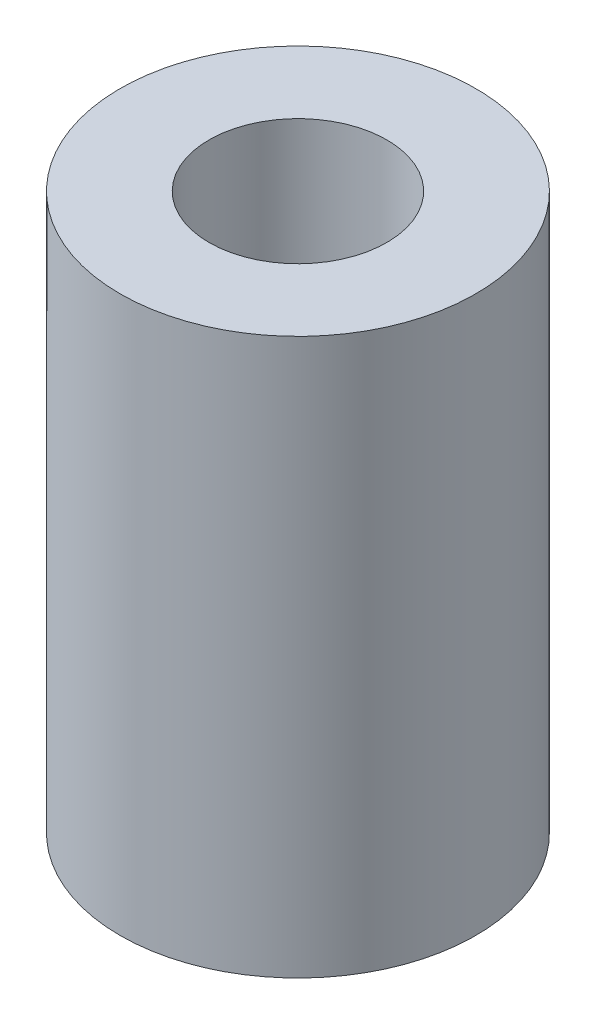
ISO-10303-21;
HEADER;
FILE_DESCRIPTION(('STEP AP214'),'2;1');
FILE_NAME('part.step','',(''),(''),'','','');
FILE_SCHEMA(('AUTOMOTIVE_DESIGN { 1 0 10303 214 1 1 1 1 }'));
ENDSEC;
DATA;
#1=APPLICATION_CONTEXT('core data for automotive mechanical design processes');
#2=APPLICATION_PROTOCOL_DEFINITION('international standard','automotive_design',2000,#1);
#3=PRODUCT_CONTEXT('',#1,'mechanical');
#4=PRODUCT('Part','Part','',(#3));
#5=PRODUCT_RELATED_PRODUCT_CATEGORY('part','',(#4));
#6=PRODUCT_DEFINITION_FORMATION('','',#4);
#7=PRODUCT_DEFINITION_CONTEXT('part definition',#1,'design');
#8=PRODUCT_DEFINITION('design','',#6,#7);
#9=PRODUCT_DEFINITION_SHAPE('','',#8);
#10=(LENGTH_UNIT() NAMED_UNIT(*) SI_UNIT(.MILLI.,.METRE.));
#11=(NAMED_UNIT(*) PLANE_ANGLE_UNIT() SI_UNIT($,.RADIAN.));
#12=(NAMED_UNIT(*) SI_UNIT($,.STERADIAN.) SOLID_ANGLE_UNIT());
#13=UNCERTAINTY_MEASURE_WITH_UNIT(LENGTH_MEASURE(1.E-05),#10,'distance_accuracy_value','');
#14=(GEOMETRIC_REPRESENTATION_CONTEXT(3) GLOBAL_UNCERTAINTY_ASSIGNED_CONTEXT((#13)) GLOBAL_UNIT_ASSIGNED_CONTEXT((#10,
#11,#12)) REPRESENTATION_CONTEXT('',''));
#15=CARTESIAN_POINT('',(0.,0.,0.));
#16=DIRECTION('',(0.,0.,1.));
#17=DIRECTION('',(1.,0.,0.));
#18=AXIS2_PLACEMENT_3D('',#15,#16,#17);
#19=CARTESIAN_POINT('',(0.,12.5,0.));
#20=DIRECTION('',(0.,1.,0.));
#21=DIRECTION('',(0.,0.,1.));
#22=AXIS2_PLACEMENT_3D('',#19,#20,#21);
#23=PLANE('',#22);
#24=CARTESIAN_POINT('',(0.,12.5,0.));
#25=DIRECTION('',(0.,1.,0.));
#26=DIRECTION('',(0.,0.,1.));
#27=AXIS2_PLACEMENT_3D('',#24,#25,#26);
#28=CIRCLE('',#27,4.);
#29=CARTESIAN_POINT('',(0.,12.5,4.));
#30=VERTEX_POINT('',#29);
#31=EDGE_CURVE('E10',#30,#30,#28,.T.);
#32=ORIENTED_EDGE('',*,*,#31,.T.);
#33=EDGE_LOOP('',(#32));
#34=FACE_BOUND('',#33,.T.);
#35=CARTESIAN_POINT('',(0.,12.5,0.));
#36=DIRECTION('',(0.,1.,0.));
#37=DIRECTION('',(0.,0.,1.));
#38=AXIS2_PLACEMENT_3D('',#35,#36,#37);
#39=CIRCLE('',#38,2.);
#40=CARTESIAN_POINT('',(0.,12.5,2.));
#41=VERTEX_POINT('',#40);
#42=EDGE_CURVE('E50',#41,#41,#39,.T.);
#43=ORIENTED_EDGE('',*,*,#42,.F.);
#44=EDGE_LOOP('',(#43));
#45=FACE_BOUND('',#44,.T.);
#46=ADVANCED_FACE('F37',(#34,#45),#23,.T.);
#47=CARTESIAN_POINT('',(0.,0.,0.));
#48=DIRECTION('',(0.,1.,0.));
#49=DIRECTION('',(0.,0.,1.));
#50=AXIS2_PLACEMENT_3D('',#47,#48,#49);
#51=PLANE('',#50);
#52=CARTESIAN_POINT('',(0.,0.,0.));
#53=DIRECTION('',(0.,1.,0.));
#54=DIRECTION('',(0.,0.,1.));
#55=AXIS2_PLACEMENT_3D('',#52,#53,#54);
#56=CIRCLE('',#55,4.);
#57=CARTESIAN_POINT('',(0.,0.,4.));
#58=VERTEX_POINT('',#57);
#59=EDGE_CURVE('E41',#58,#58,#56,.T.);
#60=ORIENTED_EDGE('',*,*,#59,.F.);
#61=EDGE_LOOP('',(#60));
#62=FACE_BOUND('',#61,.T.);
#63=CARTESIAN_POINT('',(0.,0.,0.));
#64=DIRECTION('',(0.,1.,0.));
#65=DIRECTION('',(0.,0.,1.));
#66=AXIS2_PLACEMENT_3D('',#63,#64,#65);
#67=CIRCLE('',#66,2.);
#68=CARTESIAN_POINT('',(0.,0.,2.));
#69=VERTEX_POINT('',#68);
#70=EDGE_CURVE('E52',#69,#69,#67,.T.);
#71=ORIENTED_EDGE('',*,*,#70,.T.);
#72=EDGE_LOOP('',(#71));
#73=FACE_BOUND('',#72,.T.);
#74=ADVANCED_FACE('F64',(#62,#73),#51,.F.);
#75=CARTESIAN_POINT('',(0.,12.5,0.));
#76=DIRECTION('',(0.,-1.,0.));
#77=DIRECTION('',(0.,0.,-1.));
#78=AXIS2_PLACEMENT_3D('',#75,#76,#77);
#79=CYLINDRICAL_SURFACE('',#78,4.);
#80=ORIENTED_EDGE('',*,*,#31,.F.);
#81=EDGE_LOOP('',(#80));
#82=FACE_BOUND('',#81,.T.);
#83=ORIENTED_EDGE('',*,*,#59,.T.);
#84=EDGE_LOOP('',(#83));
#85=FACE_BOUND('',#84,.T.);
#86=ADVANCED_FACE('F39',(#82,#85),#79,.T.);
#87=CARTESIAN_POINT('',(0.,12.5,0.));
#88=DIRECTION('',(0.,-1.,0.));
#89=DIRECTION('',(0.,0.,-1.));
#90=AXIS2_PLACEMENT_3D('',#87,#88,#89);
#91=CYLINDRICAL_SURFACE('',#90,2.);
#92=ORIENTED_EDGE('',*,*,#42,.T.);
#93=EDGE_LOOP('',(#92));
#94=FACE_BOUND('',#93,.T.);
#95=ORIENTED_EDGE('',*,*,#70,.F.);
#96=EDGE_LOOP('',(#95));
#97=FACE_BOUND('',#96,.T.);
#98=ADVANCED_FACE('F60',(#94,#97),#91,.F.);
#99=CLOSED_SHELL('',(#46,#74,#86,#98));
#100=MANIFOLD_SOLID_BREP('B2',#99);
#101=ADVANCED_BREP_SHAPE_REPRESENTATION('',(#18,#100),#14);
#102=SHAPE_DEFINITION_REPRESENTATION(#9,#101);
ENDSEC;
END-ISO-10303-21;
